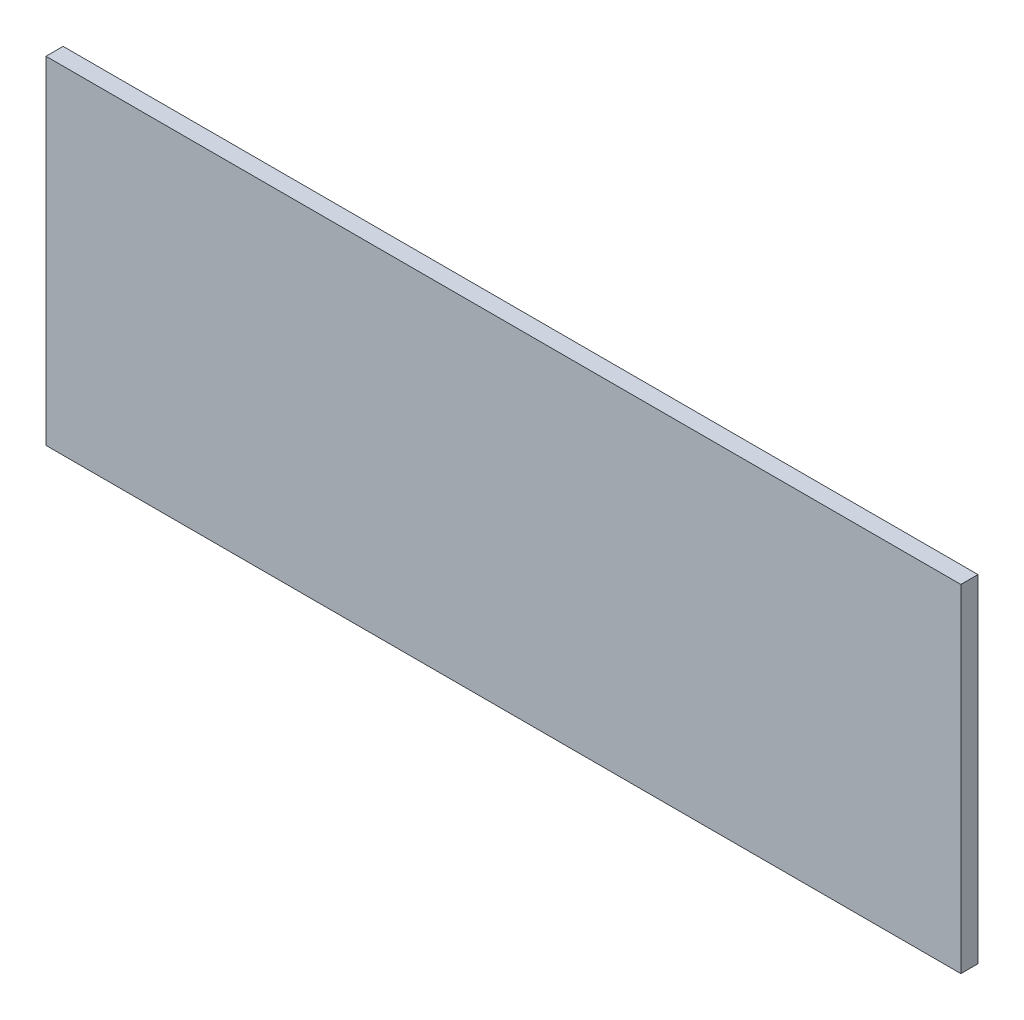
ISO-10303-21;
HEADER;
FILE_DESCRIPTION(('STEP AP214'),'2;1');
FILE_NAME('part.step','',(''),(''),'','','');
FILE_SCHEMA(('AUTOMOTIVE_DESIGN { 1 0 10303 214 1 1 1 1 }'));
ENDSEC;
DATA;
#1=APPLICATION_CONTEXT('core data for automotive mechanical design processes');
#2=APPLICATION_PROTOCOL_DEFINITION('international standard','automotive_design',2000,#1);
#3=PRODUCT_CONTEXT('',#1,'mechanical');
#4=PRODUCT('Part','Part','',(#3));
#5=PRODUCT_RELATED_PRODUCT_CATEGORY('part','',(#4));
#6=PRODUCT_DEFINITION_FORMATION('','',#4);
#7=PRODUCT_DEFINITION_CONTEXT('part definition',#1,'design');
#8=PRODUCT_DEFINITION('design','',#6,#7);
#9=PRODUCT_DEFINITION_SHAPE('','',#8);
#10=(LENGTH_UNIT() NAMED_UNIT(*) SI_UNIT(.MILLI.,.METRE.));
#11=(NAMED_UNIT(*) PLANE_ANGLE_UNIT() SI_UNIT($,.RADIAN.));
#12=(NAMED_UNIT(*) SI_UNIT($,.STERADIAN.) SOLID_ANGLE_UNIT());
#13=UNCERTAINTY_MEASURE_WITH_UNIT(LENGTH_MEASURE(1.E-05),#10,'distance_accuracy_value','');
#14=(GEOMETRIC_REPRESENTATION_CONTEXT(3) GLOBAL_UNCERTAINTY_ASSIGNED_CONTEXT((#13)) GLOBAL_UNIT_ASSIGNED_CONTEXT((#10,
#11,#12)) REPRESENTATION_CONTEXT('',''));
#15=CARTESIAN_POINT('',(0.,0.,0.));
#16=DIRECTION('',(0.,0.,1.));
#17=DIRECTION('',(1.,0.,0.));
#18=AXIS2_PLACEMENT_3D('',#15,#16,#17);
#19=CARTESIAN_POINT('',(81.8669967651367,60.0870018005371,0.));
#20=DIRECTION('',(0.,1.,0.));
#21=DIRECTION('',(1.,0.,0.));
#22=AXIS2_PLACEMENT_3D('',#19,#20,#21);
#23=PLANE('',#22);
#24=DIRECTION('',(1.,0.,0.));
#25=VECTOR('',#24,1.);
#26=CARTESIAN_POINT('',(81.8669967651367,60.0870018005371,0.03556));
#27=LINE('',#26,#25);
#28=CARTESIAN_POINT('',(81.8669967651367,60.0870018005371,0.03556));
#29=VERTEX_POINT('',#28);
#30=CARTESIAN_POINT('',(83.7669982910156,60.0870018005371,0.03556));
#31=VERTEX_POINT('',#30);
#32=EDGE_CURVE('E11',#29,#31,#27,.T.);
#33=ORIENTED_EDGE('',*,*,#32,.F.);
#34=DIRECTION('',(0.,0.,1.));
#35=VECTOR('',#34,1.);
#36=CARTESIAN_POINT('',(81.8669967651367,60.0870018005371,0.));
#37=LINE('',#36,#35);
#38=CARTESIAN_POINT('',(81.8669967651367,60.0870018005371,0.));
#39=VERTEX_POINT('',#38);
#40=EDGE_CURVE('E24',#39,#29,#37,.T.);
#41=ORIENTED_EDGE('',*,*,#40,.F.);
#42=DIRECTION('',(1.,0.,0.));
#43=VECTOR('',#42,1.);
#44=CARTESIAN_POINT('',(81.8669967651367,60.0870018005371,0.));
#45=LINE('',#44,#43);
#46=CARTESIAN_POINT('',(83.7669982910156,60.0870018005371,0.));
#47=VERTEX_POINT('',#46);
#48=EDGE_CURVE('E75',#39,#47,#45,.T.);
#49=ORIENTED_EDGE('',*,*,#48,.T.);
#50=DIRECTION('',(0.,0.,1.));
#51=VECTOR('',#50,1.);
#52=CARTESIAN_POINT('',(83.7669982910156,60.0870018005371,0.));
#53=LINE('',#52,#51);
#54=EDGE_CURVE('E37',#47,#31,#53,.T.);
#55=ORIENTED_EDGE('',*,*,#54,.T.);
#56=EDGE_LOOP('',(#33,#41,#49,#55));
#57=FACE_BOUND('',#56,.T.);
#58=ADVANCED_FACE('F17',(#57),#23,.F.);
#59=CARTESIAN_POINT('',(83.7669982910156,60.0870018005371,0.));
#60=DIRECTION('',(-1.,0.,0.));
#61=DIRECTION('',(0.,1.,0.));
#62=AXIS2_PLACEMENT_3D('',#59,#60,#61);
#63=PLANE('',#62);
#64=DIRECTION('',(0.,1.,0.));
#65=VECTOR('',#64,1.);
#66=CARTESIAN_POINT('',(83.7669982910156,60.0870018005371,0.03556));
#67=LINE('',#66,#65);
#68=CARTESIAN_POINT('',(83.7669982910156,60.7869987487793,0.03556));
#69=VERTEX_POINT('',#68);
#70=EDGE_CURVE('E83',#31,#69,#67,.T.);
#71=ORIENTED_EDGE('',*,*,#70,.F.);
#72=ORIENTED_EDGE('',*,*,#54,.F.);
#73=DIRECTION('',(0.,1.,0.));
#74=VECTOR('',#73,1.);
#75=CARTESIAN_POINT('',(83.7669982910156,60.0870018005371,0.));
#76=LINE('',#75,#74);
#77=CARTESIAN_POINT('',(83.7669982910156,60.7869987487793,0.));
#78=VERTEX_POINT('',#77);
#79=EDGE_CURVE('E81',#47,#78,#76,.T.);
#80=ORIENTED_EDGE('',*,*,#79,.T.);
#81=DIRECTION('',(0.,0.,1.));
#82=VECTOR('',#81,1.);
#83=CARTESIAN_POINT('',(83.7669982910156,60.7869987487793,0.));
#84=LINE('',#83,#82);
#85=EDGE_CURVE('E67',#78,#69,#84,.T.);
#86=ORIENTED_EDGE('',*,*,#85,.T.);
#87=EDGE_LOOP('',(#71,#72,#80,#86));
#88=FACE_BOUND('',#87,.T.);
#89=ADVANCED_FACE('F89',(#88),#63,.F.);
#90=CARTESIAN_POINT('',(83.7669982910156,60.7869987487793,0.));
#91=DIRECTION('',(0.,-1.,0.));
#92=DIRECTION('',(-1.,0.,0.));
#93=AXIS2_PLACEMENT_3D('',#90,#91,#92);
#94=PLANE('',#93);
#95=DIRECTION('',(-1.,0.,0.));
#96=VECTOR('',#95,1.);
#97=CARTESIAN_POINT('',(83.7669982910156,60.7869987487793,0.03556));
#98=LINE('',#97,#96);
#99=CARTESIAN_POINT('',(81.8669967651367,60.7869987487793,0.03556));
#100=VERTEX_POINT('',#99);
#101=EDGE_CURVE('E71',#69,#100,#98,.T.);
#102=ORIENTED_EDGE('',*,*,#101,.F.);
#103=ORIENTED_EDGE('',*,*,#85,.F.);
#104=DIRECTION('',(-1.,0.,0.));
#105=VECTOR('',#104,1.);
#106=CARTESIAN_POINT('',(83.7669982910156,60.7869987487793,0.));
#107=LINE('',#106,#105);
#108=CARTESIAN_POINT('',(81.8669967651367,60.7869987487793,0.));
#109=VERTEX_POINT('',#108);
#110=EDGE_CURVE('E63',#78,#109,#107,.T.);
#111=ORIENTED_EDGE('',*,*,#110,.T.);
#112=DIRECTION('',(0.,0.,1.));
#113=VECTOR('',#112,1.);
#114=CARTESIAN_POINT('',(81.8669967651367,60.7869987487793,0.));
#115=LINE('',#114,#113);
#116=EDGE_CURVE('E53',#109,#100,#115,.T.);
#117=ORIENTED_EDGE('',*,*,#116,.T.);
#118=EDGE_LOOP('',(#102,#103,#111,#117));
#119=FACE_BOUND('',#118,.T.);
#120=ADVANCED_FACE('F66',(#119),#94,.F.);
#121=CARTESIAN_POINT('',(81.8669967651367,60.7869987487793,0.));
#122=DIRECTION('',(1.,0.,0.));
#123=DIRECTION('',(0.,-1.,0.));
#124=AXIS2_PLACEMENT_3D('',#121,#122,#123);
#125=PLANE('',#124);
#126=DIRECTION('',(0.,-1.,0.));
#127=VECTOR('',#126,1.);
#128=CARTESIAN_POINT('',(81.8669967651367,60.7869987487793,0.03556));
#129=LINE('',#128,#127);
#130=EDGE_CURVE('E59',#100,#29,#129,.T.);
#131=ORIENTED_EDGE('',*,*,#130,.F.);
#132=ORIENTED_EDGE('',*,*,#116,.F.);
#133=DIRECTION('',(0.,-1.,0.));
#134=VECTOR('',#133,1.);
#135=CARTESIAN_POINT('',(81.8669967651367,60.7869987487793,0.));
#136=LINE('',#135,#134);
#137=EDGE_CURVE('E57',#109,#39,#136,.T.);
#138=ORIENTED_EDGE('',*,*,#137,.T.);
#139=ORIENTED_EDGE('',*,*,#40,.T.);
#140=EDGE_LOOP('',(#131,#132,#138,#139));
#141=FACE_BOUND('',#140,.T.);
#142=ADVANCED_FACE('F55',(#141),#125,.F.);
#143=CARTESIAN_POINT('',(81.8669967651367,60.0870018005371,0.));
#144=DIRECTION('',(0.,0.,-1.));
#145=DIRECTION('',(-1.,0.,0.));
#146=AXIS2_PLACEMENT_3D('',#143,#144,#145);
#147=PLANE('',#146);
#148=ORIENTED_EDGE('',*,*,#137,.F.);
#149=ORIENTED_EDGE('',*,*,#110,.F.);
#150=ORIENTED_EDGE('',*,*,#79,.F.);
#151=ORIENTED_EDGE('',*,*,#48,.F.);
#152=EDGE_LOOP('',(#148,#149,#150,#151));
#153=FACE_BOUND('',#152,.T.);
#154=ADVANCED_FACE('F74',(#153),#147,.T.);
#155=CARTESIAN_POINT('',(81.8669967651367,60.0870018005371,0.03556));
#156=DIRECTION('',(0.,0.,-1.));
#157=DIRECTION('',(-1.,0.,0.));
#158=AXIS2_PLACEMENT_3D('',#155,#156,#157);
#159=PLANE('',#158);
#160=ORIENTED_EDGE('',*,*,#32,.T.);
#161=ORIENTED_EDGE('',*,*,#70,.T.);
#162=ORIENTED_EDGE('',*,*,#101,.T.);
#163=ORIENTED_EDGE('',*,*,#130,.T.);
#164=EDGE_LOOP('',(#160,#161,#162,#163));
#165=FACE_BOUND('',#164,.T.);
#166=ADVANCED_FACE('F91',(#165),#159,.F.);
#167=CLOSED_SHELL('',(#58,#89,#120,#142,#154,#166));
#168=MANIFOLD_SOLID_BREP('B1',#167);
#169=ADVANCED_BREP_SHAPE_REPRESENTATION('',(#18,#168),#14);
#170=SHAPE_DEFINITION_REPRESENTATION(#9,#169);
ENDSEC;
END-ISO-10303-21;
